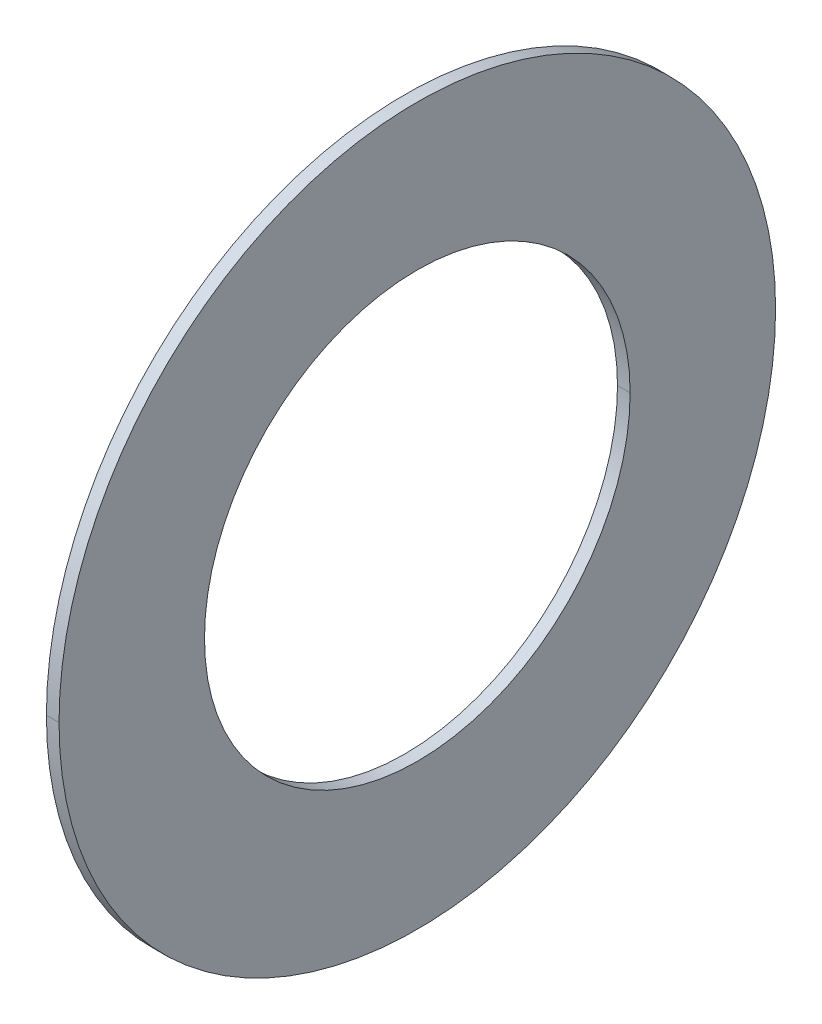
ISO-10303-21;
HEADER;
FILE_DESCRIPTION(('STEP AP214'),'2;1');
FILE_NAME('part.step','',(''),(''),'','','');
FILE_SCHEMA(('AUTOMOTIVE_DESIGN { 1 0 10303 214 1 1 1 1 }'));
ENDSEC;
DATA;
#1=APPLICATION_CONTEXT('core data for automotive mechanical design processes');
#2=APPLICATION_PROTOCOL_DEFINITION('international standard','automotive_design',2000,#1);
#3=PRODUCT_CONTEXT('',#1,'mechanical');
#4=PRODUCT('Part','Part','',(#3));
#5=PRODUCT_RELATED_PRODUCT_CATEGORY('part','',(#4));
#6=PRODUCT_DEFINITION_FORMATION('','',#4);
#7=PRODUCT_DEFINITION_CONTEXT('part definition',#1,'design');
#8=PRODUCT_DEFINITION('design','',#6,#7);
#9=PRODUCT_DEFINITION_SHAPE('','',#8);
#10=(LENGTH_UNIT() NAMED_UNIT(*) SI_UNIT(.MILLI.,.METRE.));
#11=(NAMED_UNIT(*) PLANE_ANGLE_UNIT() SI_UNIT($,.RADIAN.));
#12=(NAMED_UNIT(*) SI_UNIT($,.STERADIAN.) SOLID_ANGLE_UNIT());
#13=UNCERTAINTY_MEASURE_WITH_UNIT(LENGTH_MEASURE(1.E-05),#10,'distance_accuracy_value','');
#14=(GEOMETRIC_REPRESENTATION_CONTEXT(3) GLOBAL_UNCERTAINTY_ASSIGNED_CONTEXT((#13)) GLOBAL_UNIT_ASSIGNED_CONTEXT((#10,
#11,#12)) REPRESENTATION_CONTEXT('',''));
#15=CARTESIAN_POINT('',(0.,0.,0.));
#16=DIRECTION('',(0.,0.,1.));
#17=DIRECTION('',(1.,0.,0.));
#18=AXIS2_PLACEMENT_3D('',#15,#16,#17);
#19=CARTESIAN_POINT('',(0.3125,6.65,0.));
#20=DIRECTION('',(-1.,0.,0.));
#21=DIRECTION('',(0.,0.,1.));
#22=AXIS2_PLACEMENT_3D('',#19,#20,#21);
#23=PLANE('',#22);
#24=CARTESIAN_POINT('',(0.3125,0.,0.));
#25=DIRECTION('',(1.,0.,0.));
#26=DIRECTION('',(0.,0.,-1.));
#27=AXIS2_PLACEMENT_3D('',#24,#25,#26);
#28=CIRCLE('',#27,3.95);
#29=CARTESIAN_POINT('',(0.3125,0.,-3.95));
#30=VERTEX_POINT('',#29);
#31=CARTESIAN_POINT('',(0.3125,0.,3.95));
#32=VERTEX_POINT('',#31);
#33=EDGE_CURVE('E11',#30,#32,#28,.T.);
#34=ORIENTED_EDGE('',*,*,#33,.T.);
#35=CARTESIAN_POINT('',(0.3125,0.,0.));
#36=DIRECTION('',(1.,0.,0.));
#37=DIRECTION('',(0.,0.,-1.));
#38=AXIS2_PLACEMENT_3D('',#35,#36,#37);
#39=CIRCLE('',#38,3.95);
#40=EDGE_CURVE('E25',#32,#30,#39,.T.);
#41=ORIENTED_EDGE('',*,*,#40,.T.);
#42=EDGE_LOOP('',(#34,#41));
#43=FACE_BOUND('',#42,.T.);
#44=CARTESIAN_POINT('',(0.3125,0.,0.));
#45=DIRECTION('',(1.,0.,0.));
#46=DIRECTION('',(0.,0.,-1.));
#47=AXIS2_PLACEMENT_3D('',#44,#45,#46);
#48=CIRCLE('',#47,6.65);
#49=CARTESIAN_POINT('',(0.3125,0.,-6.65));
#50=VERTEX_POINT('',#49);
#51=CARTESIAN_POINT('',(0.3125,0.,6.65));
#52=VERTEX_POINT('',#51);
#53=EDGE_CURVE('E96',#50,#52,#48,.T.);
#54=ORIENTED_EDGE('',*,*,#53,.F.);
#55=CARTESIAN_POINT('',(0.3125,0.,0.));
#56=DIRECTION('',(1.,0.,0.));
#57=DIRECTION('',(0.,0.,-1.));
#58=AXIS2_PLACEMENT_3D('',#55,#56,#57);
#59=CIRCLE('',#58,6.65);
#60=EDGE_CURVE('E91',#52,#50,#59,.T.);
#61=ORIENTED_EDGE('',*,*,#60,.F.);
#62=EDGE_LOOP('',(#54,#61));
#63=FACE_BOUND('',#62,.T.);
#64=ADVANCED_FACE('F17',(#43,#63),#23,.T.);
#65=CARTESIAN_POINT('',(0.54675,0.,0.));
#66=DIRECTION('',(-1.,0.,0.));
#67=DIRECTION('',(0.,1.,0.));
#68=AXIS2_PLACEMENT_3D('',#65,#66,#67);
#69=CYLINDRICAL_SURFACE('',#68,6.65);
#70=ORIENTED_EDGE('',*,*,#60,.T.);
#71=DIRECTION('',(-1.,0.,0.));
#72=VECTOR('',#71,1.);
#73=CARTESIAN_POINT('',(0.54675,0.,-6.65));
#74=LINE('',#73,#72);
#75=CARTESIAN_POINT('',(0.54675,0.,-6.65));
#76=VERTEX_POINT('',#75);
#77=EDGE_CURVE('E86',#76,#50,#74,.T.);
#78=ORIENTED_EDGE('',*,*,#77,.F.);
#79=CARTESIAN_POINT('',(0.54675,0.,0.));
#80=DIRECTION('',(1.,0.,0.));
#81=DIRECTION('',(0.,0.,-1.));
#82=AXIS2_PLACEMENT_3D('',#79,#80,#81);
#83=CIRCLE('',#82,6.65);
#84=CARTESIAN_POINT('',(0.54675,0.,6.65));
#85=VERTEX_POINT('',#84);
#86=EDGE_CURVE('E81',#85,#76,#83,.T.);
#87=ORIENTED_EDGE('',*,*,#86,.F.);
#88=DIRECTION('',(-1.,0.,0.));
#89=VECTOR('',#88,1.);
#90=CARTESIAN_POINT('',(0.54675,0.,6.65));
#91=LINE('',#90,#89);
#92=EDGE_CURVE('E70',#85,#52,#91,.T.);
#93=ORIENTED_EDGE('',*,*,#92,.T.);
#94=EDGE_LOOP('',(#70,#78,#87,#93));
#95=FACE_BOUND('',#94,.T.);
#96=ADVANCED_FACE('F111',(#95),#69,.T.);
#97=CARTESIAN_POINT('',(0.54675,0.,0.));
#98=DIRECTION('',(-1.,0.,0.));
#99=DIRECTION('',(0.,-1.,0.));
#100=AXIS2_PLACEMENT_3D('',#97,#98,#99);
#101=CYLINDRICAL_SURFACE('',#100,6.65);
#102=CARTESIAN_POINT('',(0.54675,0.,0.));
#103=DIRECTION('',(1.,0.,0.));
#104=DIRECTION('',(0.,0.,-1.));
#105=AXIS2_PLACEMENT_3D('',#102,#103,#104);
#106=CIRCLE('',#105,6.65);
#107=EDGE_CURVE('E67',#76,#85,#106,.T.);
#108=ORIENTED_EDGE('',*,*,#107,.F.);
#109=ORIENTED_EDGE('',*,*,#77,.T.);
#110=ORIENTED_EDGE('',*,*,#53,.T.);
#111=ORIENTED_EDGE('',*,*,#92,.F.);
#112=EDGE_LOOP('',(#108,#109,#110,#111));
#113=FACE_BOUND('',#112,.T.);
#114=ADVANCED_FACE('F108',(#113),#101,.T.);
#115=CARTESIAN_POINT('',(0.54675,3.95,0.));
#116=DIRECTION('',(1.,0.,0.));
#117=DIRECTION('',(0.,0.,-1.));
#118=AXIS2_PLACEMENT_3D('',#115,#116,#117);
#119=PLANE('',#118);
#120=ORIENTED_EDGE('',*,*,#107,.T.);
#121=ORIENTED_EDGE('',*,*,#86,.T.);
#122=EDGE_LOOP('',(#120,#121));
#123=FACE_BOUND('',#122,.T.);
#124=CARTESIAN_POINT('',(0.54675,0.,0.));
#125=DIRECTION('',(1.,0.,0.));
#126=DIRECTION('',(0.,0.,-1.));
#127=AXIS2_PLACEMENT_3D('',#124,#125,#126);
#128=CIRCLE('',#127,3.95);
#129=CARTESIAN_POINT('',(0.54675,0.,-3.95));
#130=VERTEX_POINT('',#129);
#131=CARTESIAN_POINT('',(0.54675,0.,3.95));
#132=VERTEX_POINT('',#131);
#133=EDGE_CURVE('E56',#130,#132,#128,.T.);
#134=ORIENTED_EDGE('',*,*,#133,.F.);
#135=CARTESIAN_POINT('',(0.54675,0.,0.));
#136=DIRECTION('',(1.,0.,0.));
#137=DIRECTION('',(0.,0.,-1.));
#138=AXIS2_PLACEMENT_3D('',#135,#136,#137);
#139=CIRCLE('',#138,3.95);
#140=EDGE_CURVE('E52',#132,#130,#139,.T.);
#141=ORIENTED_EDGE('',*,*,#140,.F.);
#142=EDGE_LOOP('',(#134,#141));
#143=FACE_BOUND('',#142,.T.);
#144=ADVANCED_FACE('F54',(#123,#143),#119,.T.);
#145=CARTESIAN_POINT('',(0.54675,0.,0.));
#146=DIRECTION('',(-1.,0.,0.));
#147=DIRECTION('',(0.,1.,0.));
#148=AXIS2_PLACEMENT_3D('',#145,#146,#147);
#149=CYLINDRICAL_SURFACE('',#148,3.95);
#150=ORIENTED_EDGE('',*,*,#40,.F.);
#151=DIRECTION('',(-1.,0.,0.));
#152=VECTOR('',#151,1.);
#153=CARTESIAN_POINT('',(0.54675,0.,3.95));
#154=LINE('',#153,#152);
#155=EDGE_CURVE('E59',#132,#32,#154,.T.);
#156=ORIENTED_EDGE('',*,*,#155,.F.);
#157=ORIENTED_EDGE('',*,*,#140,.T.);
#158=DIRECTION('',(-1.,0.,0.));
#159=VECTOR('',#158,1.);
#160=CARTESIAN_POINT('',(0.54675,0.,-3.95));
#161=LINE('',#160,#159);
#162=EDGE_CURVE('E64',#130,#30,#161,.T.);
#163=ORIENTED_EDGE('',*,*,#162,.T.);
#164=EDGE_LOOP('',(#150,#156,#157,#163));
#165=FACE_BOUND('',#164,.T.);
#166=ADVANCED_FACE('F62',(#165),#149,.F.);
#167=CARTESIAN_POINT('',(0.54675,0.,0.));
#168=DIRECTION('',(-1.,0.,0.));
#169=DIRECTION('',(0.,-1.,0.));
#170=AXIS2_PLACEMENT_3D('',#167,#168,#169);
#171=CYLINDRICAL_SURFACE('',#170,3.95);
#172=ORIENTED_EDGE('',*,*,#133,.T.);
#173=ORIENTED_EDGE('',*,*,#155,.T.);
#174=ORIENTED_EDGE('',*,*,#33,.F.);
#175=ORIENTED_EDGE('',*,*,#162,.F.);
#176=EDGE_LOOP('',(#172,#173,#174,#175));
#177=FACE_BOUND('',#176,.T.);
#178=ADVANCED_FACE('F66',(#177),#171,.F.);
#179=CLOSED_SHELL('',(#64,#96,#114,#144,#166,#178));
#180=MANIFOLD_SOLID_BREP('B1',#179);
#181=ADVANCED_BREP_SHAPE_REPRESENTATION('',(#18,#180),#14);
#182=SHAPE_DEFINITION_REPRESENTATION(#9,#181);
ENDSEC;
END-ISO-10303-21;
